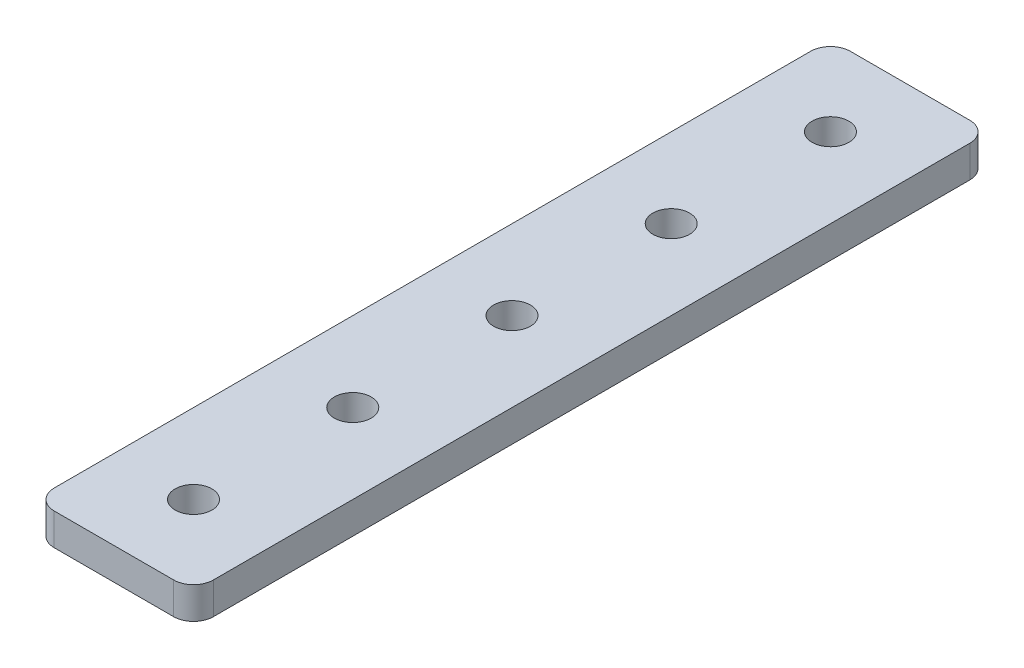
ISO-10303-21;
HEADER;
FILE_DESCRIPTION(('STEP AP214'),'2;1');
FILE_NAME('part.step','',(''),(''),'','','');
FILE_SCHEMA(('AUTOMOTIVE_DESIGN { 1 0 10303 214 1 1 1 1 }'));
ENDSEC;
DATA;
#1=APPLICATION_CONTEXT('core data for automotive mechanical design processes');
#2=APPLICATION_PROTOCOL_DEFINITION('international standard','automotive_design',2000,#1);
#3=PRODUCT_CONTEXT('',#1,'mechanical');
#4=PRODUCT('Part','Part','',(#3));
#5=PRODUCT_RELATED_PRODUCT_CATEGORY('part','',(#4));
#6=PRODUCT_DEFINITION_FORMATION('','',#4);
#7=PRODUCT_DEFINITION_CONTEXT('part definition',#1,'design');
#8=PRODUCT_DEFINITION('design','',#6,#7);
#9=PRODUCT_DEFINITION_SHAPE('','',#8);
#10=(LENGTH_UNIT() NAMED_UNIT(*) SI_UNIT(.MILLI.,.METRE.));
#11=(NAMED_UNIT(*) PLANE_ANGLE_UNIT() SI_UNIT($,.RADIAN.));
#12=(NAMED_UNIT(*) SI_UNIT($,.STERADIAN.) SOLID_ANGLE_UNIT());
#13=UNCERTAINTY_MEASURE_WITH_UNIT(LENGTH_MEASURE(1.E-05),#10,'distance_accuracy_value','');
#14=(GEOMETRIC_REPRESENTATION_CONTEXT(3) GLOBAL_UNCERTAINTY_ASSIGNED_CONTEXT((#13)) GLOBAL_UNIT_ASSIGNED_CONTEXT((#10,
#11,#12)) REPRESENTATION_CONTEXT('',''));
#15=CARTESIAN_POINT('',(0.,0.,0.));
#16=DIRECTION('',(0.,0.,1.));
#17=DIRECTION('',(1.,0.,0.));
#18=AXIS2_PLACEMENT_3D('',#15,#16,#17);
#19=CARTESIAN_POINT('',(-38.6467729963785,364.577314871582,-80.));
#20=DIRECTION('',(0.,0.,-1.));
#21=DIRECTION('',(-1.,0.,0.));
#22=AXIS2_PLACEMENT_3D('',#19,#20,#21);
#23=PLANE('',#22);
#24=DIRECTION('',(-1.,0.,0.));
#25=VECTOR('',#24,1.);
#26=CARTESIAN_POINT('',(6.,3.2,-80.));
#27=LINE('',#26,#25);
#28=CARTESIAN_POINT('',(6.,3.2,-80.));
#29=VERTEX_POINT('',#28);
#30=CARTESIAN_POINT('',(-6.,3.2,-80.));
#31=VERTEX_POINT('',#30);
#32=EDGE_CURVE('E146',#29,#31,#27,.T.);
#33=ORIENTED_EDGE('',*,*,#32,.F.);
#34=DIRECTION('',(0.,1.,0.));
#35=VECTOR('',#34,1.);
#36=CARTESIAN_POINT('',(6.,364.577314871582,-80.));
#37=LINE('',#36,#35);
#38=CARTESIAN_POINT('',(6.,0.,-80.));
#39=VERTEX_POINT('',#38);
#40=EDGE_CURVE('E161',#29,#39,#37,.F.);
#41=ORIENTED_EDGE('',*,*,#40,.T.);
#42=DIRECTION('',(-1.,0.,0.));
#43=VECTOR('',#42,1.);
#44=CARTESIAN_POINT('',(6.,0.,-80.));
#45=LINE('',#44,#43);
#46=CARTESIAN_POINT('',(-6.,0.,-80.));
#47=VERTEX_POINT('',#46);
#48=EDGE_CURVE('E166',#39,#47,#45,.T.);
#49=ORIENTED_EDGE('',*,*,#48,.T.);
#50=DIRECTION('',(0.,-1.,0.));
#51=VECTOR('',#50,1.);
#52=CARTESIAN_POINT('',(-6.,364.577314871582,-80.));
#53=LINE('',#52,#51);
#54=EDGE_CURVE('E159',#47,#31,#53,.F.);
#55=ORIENTED_EDGE('',*,*,#54,.T.);
#56=EDGE_LOOP('',(#33,#41,#49,#55));
#57=FACE_BOUND('',#56,.T.);
#58=ADVANCED_FACE('F33',(#57),#23,.T.);
#59=CARTESIAN_POINT('',(-8.,0.,-286.));
#60=DIRECTION('',(-1.,0.,0.));
#61=DIRECTION('',(0.,0.,1.));
#62=AXIS2_PLACEMENT_3D('',#59,#60,#61);
#63=PLANE('',#62);
#64=DIRECTION('',(0.,0.,1.));
#65=VECTOR('',#64,1.);
#66=CARTESIAN_POINT('',(-8.,3.2,-286.));
#67=LINE('',#66,#65);
#68=CARTESIAN_POINT('',(-8.,3.2,-78.));
#69=VERTEX_POINT('',#68);
#70=CARTESIAN_POINT('',(-8.,3.2,-2.));
#71=VERTEX_POINT('',#70);
#72=EDGE_CURVE('E141',#69,#71,#67,.T.);
#73=ORIENTED_EDGE('',*,*,#72,.F.);
#74=DIRECTION('',(0.,-1.,0.));
#75=VECTOR('',#74,1.);
#76=CARTESIAN_POINT('',(-8.,0.,-78.));
#77=LINE('',#76,#75);
#78=CARTESIAN_POINT('',(-8.,0.,-78.));
#79=VERTEX_POINT('',#78);
#80=EDGE_CURVE('E11',#69,#79,#77,.T.);
#81=ORIENTED_EDGE('',*,*,#80,.T.);
#82=DIRECTION('',(0.,0.,1.));
#83=VECTOR('',#82,1.);
#84=CARTESIAN_POINT('',(-8.,0.,-286.));
#85=LINE('',#84,#83);
#86=CARTESIAN_POINT('',(-8.,0.,-2.));
#87=VERTEX_POINT('',#86);
#88=EDGE_CURVE('E119',#79,#87,#85,.T.);
#89=ORIENTED_EDGE('',*,*,#88,.T.);
#90=DIRECTION('',(0.,1.,0.));
#91=VECTOR('',#90,1.);
#92=CARTESIAN_POINT('',(-8.,0.,-2.));
#93=LINE('',#92,#91);
#94=EDGE_CURVE('E110',#87,#71,#93,.T.);
#95=ORIENTED_EDGE('',*,*,#94,.T.);
#96=EDGE_LOOP('',(#73,#81,#89,#95));
#97=FACE_BOUND('',#96,.T.);
#98=ADVANCED_FACE('F183',(#97),#63,.T.);
#99=CARTESIAN_POINT('',(8.,0.,-2.));
#100=DIRECTION('',(1.,0.,0.));
#101=DIRECTION('',(0.,0.,-1.));
#102=AXIS2_PLACEMENT_3D('',#99,#100,#101);
#103=PLANE('',#102);
#104=DIRECTION('',(0.,0.,-1.));
#105=VECTOR('',#104,1.);
#106=CARTESIAN_POINT('',(8.,0.,-2.));
#107=LINE('',#106,#105);
#108=CARTESIAN_POINT('',(8.,0.,-2.));
#109=VERTEX_POINT('',#108);
#110=CARTESIAN_POINT('',(8.,0.,-78.));
#111=VERTEX_POINT('',#110);
#112=EDGE_CURVE('E102',#109,#111,#107,.T.);
#113=ORIENTED_EDGE('',*,*,#112,.T.);
#114=DIRECTION('',(0.,1.,0.));
#115=VECTOR('',#114,1.);
#116=CARTESIAN_POINT('',(8.,0.,-78.));
#117=LINE('',#116,#115);
#118=CARTESIAN_POINT('',(8.,3.2,-78.));
#119=VERTEX_POINT('',#118);
#120=EDGE_CURVE('E153',#111,#119,#117,.T.);
#121=ORIENTED_EDGE('',*,*,#120,.T.);
#122=DIRECTION('',(0.,0.,-1.));
#123=VECTOR('',#122,1.);
#124=CARTESIAN_POINT('',(8.,3.2,-2.));
#125=LINE('',#124,#123);
#126=CARTESIAN_POINT('',(8.,3.2,-2.));
#127=VERTEX_POINT('',#126);
#128=EDGE_CURVE('E105',#127,#119,#125,.T.);
#129=ORIENTED_EDGE('',*,*,#128,.F.);
#130=DIRECTION('',(0.,1.,0.));
#131=VECTOR('',#130,1.);
#132=CARTESIAN_POINT('',(8.,0.,-2.));
#133=LINE('',#132,#131);
#134=EDGE_CURVE('E98',#109,#127,#133,.T.);
#135=ORIENTED_EDGE('',*,*,#134,.F.);
#136=EDGE_LOOP('',(#113,#121,#129,#135));
#137=FACE_BOUND('',#136,.T.);
#138=ADVANCED_FACE('F100',(#137),#103,.T.);
#139=CARTESIAN_POINT('',(6.,0.,-2.));
#140=DIRECTION('',(0.,1.,0.));
#141=DIRECTION('',(0.,0.,1.));
#142=AXIS2_PLACEMENT_3D('',#139,#140,#141);
#143=PLANE('',#142);
#144=CARTESIAN_POINT('',(0.,0.,-72.));
#145=DIRECTION('',(0.,1.,0.));
#146=DIRECTION('',(0.,0.,-1.));
#147=AXIS2_PLACEMENT_3D('',#144,#145,#146);
#148=CIRCLE('',#147,1.85);
#149=CARTESIAN_POINT('',(0.,0.,-73.85));
#150=VERTEX_POINT('',#149);
#151=EDGE_CURVE('E139',#150,#150,#148,.T.);
#152=ORIENTED_EDGE('',*,*,#151,.T.);
#153=EDGE_LOOP('',(#152));
#154=FACE_BOUND('',#153,.T.);
#155=CARTESIAN_POINT('',(0.,0.,-56.));
#156=DIRECTION('',(0.,1.,0.));
#157=DIRECTION('',(0.,0.,-1.));
#158=AXIS2_PLACEMENT_3D('',#155,#156,#157);
#159=CIRCLE('',#158,1.85);
#160=CARTESIAN_POINT('',(0.,0.,-57.85));
#161=VERTEX_POINT('',#160);
#162=EDGE_CURVE('E346',#161,#161,#159,.T.);
#163=ORIENTED_EDGE('',*,*,#162,.T.);
#164=EDGE_LOOP('',(#163));
#165=FACE_BOUND('',#164,.T.);
#166=CARTESIAN_POINT('',(0.,0.,-40.));
#167=DIRECTION('',(0.,1.,0.));
#168=DIRECTION('',(0.,0.,-1.));
#169=AXIS2_PLACEMENT_3D('',#166,#167,#168);
#170=CIRCLE('',#169,1.85);
#171=CARTESIAN_POINT('',(0.,0.,-41.85));
#172=VERTEX_POINT('',#171);
#173=EDGE_CURVE('E342',#172,#172,#170,.T.);
#174=ORIENTED_EDGE('',*,*,#173,.T.);
#175=EDGE_LOOP('',(#174));
#176=FACE_BOUND('',#175,.T.);
#177=CARTESIAN_POINT('',(0.,0.,-24.));
#178=DIRECTION('',(0.,1.,0.));
#179=DIRECTION('',(0.,0.,-1.));
#180=AXIS2_PLACEMENT_3D('',#177,#178,#179);
#181=CIRCLE('',#180,1.85);
#182=CARTESIAN_POINT('',(0.,0.,-25.85));
#183=VERTEX_POINT('',#182);
#184=EDGE_CURVE('E338',#183,#183,#181,.T.);
#185=ORIENTED_EDGE('',*,*,#184,.T.);
#186=EDGE_LOOP('',(#185));
#187=FACE_BOUND('',#186,.T.);
#188=CARTESIAN_POINT('',(0.,0.,-8.));
#189=DIRECTION('',(0.,1.,0.));
#190=DIRECTION('',(0.,0.,-1.));
#191=AXIS2_PLACEMENT_3D('',#188,#189,#190);
#192=CIRCLE('',#191,1.85);
#193=CARTESIAN_POINT('',(0.,0.,-9.85));
#194=VERTEX_POINT('',#193);
#195=EDGE_CURVE('E333',#194,#194,#192,.T.);
#196=ORIENTED_EDGE('',*,*,#195,.T.);
#197=EDGE_LOOP('',(#196));
#198=FACE_BOUND('',#197,.T.);
#199=ORIENTED_EDGE('',*,*,#48,.F.);
#200=CARTESIAN_POINT('',(6.,0.,-78.));
#201=DIRECTION('',(0.,1.,0.));
#202=DIRECTION('',(0.,0.,1.));
#203=AXIS2_PLACEMENT_3D('',#200,#201,#202);
#204=CIRCLE('',#203,2.);
#205=EDGE_CURVE('E41',#39,#111,#204,.F.);
#206=ORIENTED_EDGE('',*,*,#205,.T.);
#207=ORIENTED_EDGE('',*,*,#112,.F.);
#208=CARTESIAN_POINT('',(6.,0.,-2.));
#209=DIRECTION('',(0.,1.,0.));
#210=DIRECTION('',(0.,0.,1.));
#211=AXIS2_PLACEMENT_3D('',#208,#209,#210);
#212=CIRCLE('',#211,2.);
#213=CARTESIAN_POINT('',(6.,0.,0.));
#214=VERTEX_POINT('',#213);
#215=EDGE_CURVE('E116',#214,#109,#212,.T.);
#216=ORIENTED_EDGE('',*,*,#215,.F.);
#217=DIRECTION('',(1.,0.,0.));
#218=VECTOR('',#217,1.);
#219=CARTESIAN_POINT('',(-6.,0.,0.));
#220=LINE('',#219,#218);
#221=CARTESIAN_POINT('',(-6.,0.,0.));
#222=VERTEX_POINT('',#221);
#223=EDGE_CURVE('E111',#222,#214,#220,.T.);
#224=ORIENTED_EDGE('',*,*,#223,.F.);
#225=CARTESIAN_POINT('',(-6.,0.,-2.));
#226=DIRECTION('',(0.,1.,0.));
#227=DIRECTION('',(0.,0.,1.));
#228=AXIS2_PLACEMENT_3D('',#225,#226,#227);
#229=CIRCLE('',#228,2.);
#230=EDGE_CURVE('E133',#87,#222,#229,.T.);
#231=ORIENTED_EDGE('',*,*,#230,.F.);
#232=ORIENTED_EDGE('',*,*,#88,.F.);
#233=CARTESIAN_POINT('',(-6.,0.,-78.));
#234=DIRECTION('',(0.,1.,0.));
#235=DIRECTION('',(0.,0.,1.));
#236=AXIS2_PLACEMENT_3D('',#233,#234,#235);
#237=CIRCLE('',#236,2.);
#238=EDGE_CURVE('E48',#79,#47,#237,.F.);
#239=ORIENTED_EDGE('',*,*,#238,.T.);
#240=EDGE_LOOP('',(#199,#206,#207,#216,#224,#231,#232,#239));
#241=FACE_BOUND('',#240,.T.);
#242=ADVANCED_FACE('F114',(#154,#165,#176,#187,#198,#241),#143,.F.);
#243=CARTESIAN_POINT('',(6.,3.2,-2.));
#244=DIRECTION('',(0.,1.,0.));
#245=DIRECTION('',(0.,0.,1.));
#246=AXIS2_PLACEMENT_3D('',#243,#244,#245);
#247=PLANE('',#246);
#248=CARTESIAN_POINT('',(0.,3.2,-72.));
#249=DIRECTION('',(0.,1.,0.));
#250=DIRECTION('',(0.,0.,-1.));
#251=AXIS2_PLACEMENT_3D('',#248,#249,#250);
#252=CIRCLE('',#251,1.85);
#253=CARTESIAN_POINT('',(0.,3.2,-73.85));
#254=VERTEX_POINT('',#253);
#255=EDGE_CURVE('E129',#254,#254,#252,.T.);
#256=ORIENTED_EDGE('',*,*,#255,.F.);
#257=EDGE_LOOP('',(#256));
#258=FACE_BOUND('',#257,.T.);
#259=CARTESIAN_POINT('',(0.,3.2,-56.));
#260=DIRECTION('',(0.,1.,0.));
#261=DIRECTION('',(0.,0.,-1.));
#262=AXIS2_PLACEMENT_3D('',#259,#260,#261);
#263=CIRCLE('',#262,1.85);
#264=CARTESIAN_POINT('',(0.,3.2,-57.85));
#265=VERTEX_POINT('',#264);
#266=EDGE_CURVE('E321',#265,#265,#263,.T.);
#267=ORIENTED_EDGE('',*,*,#266,.F.);
#268=EDGE_LOOP('',(#267));
#269=FACE_BOUND('',#268,.T.);
#270=CARTESIAN_POINT('',(0.,3.2,-40.));
#271=DIRECTION('',(0.,1.,0.));
#272=DIRECTION('',(0.,0.,-1.));
#273=AXIS2_PLACEMENT_3D('',#270,#271,#272);
#274=CIRCLE('',#273,1.85);
#275=CARTESIAN_POINT('',(0.,3.2,-41.85));
#276=VERTEX_POINT('',#275);
#277=EDGE_CURVE('E325',#276,#276,#274,.T.);
#278=ORIENTED_EDGE('',*,*,#277,.F.);
#279=EDGE_LOOP('',(#278));
#280=FACE_BOUND('',#279,.T.);
#281=CARTESIAN_POINT('',(0.,3.2,-24.));
#282=DIRECTION('',(0.,1.,0.));
#283=DIRECTION('',(0.,0.,-1.));
#284=AXIS2_PLACEMENT_3D('',#281,#282,#283);
#285=CIRCLE('',#284,1.85);
#286=CARTESIAN_POINT('',(0.,3.2,-25.85));
#287=VERTEX_POINT('',#286);
#288=EDGE_CURVE('E329',#287,#287,#285,.T.);
#289=ORIENTED_EDGE('',*,*,#288,.F.);
#290=EDGE_LOOP('',(#289));
#291=FACE_BOUND('',#290,.T.);
#292=CARTESIAN_POINT('',(0.,3.2,-8.));
#293=DIRECTION('',(0.,1.,0.));
#294=DIRECTION('',(0.,0.,-1.));
#295=AXIS2_PLACEMENT_3D('',#292,#293,#294);
#296=CIRCLE('',#295,1.85);
#297=CARTESIAN_POINT('',(0.,3.2,-9.85));
#298=VERTEX_POINT('',#297);
#299=EDGE_CURVE('E168',#298,#298,#296,.T.);
#300=ORIENTED_EDGE('',*,*,#299,.F.);
#301=EDGE_LOOP('',(#300));
#302=FACE_BOUND('',#301,.T.);
#303=ORIENTED_EDGE('',*,*,#128,.T.);
#304=CARTESIAN_POINT('',(6.,3.2,-78.));
#305=DIRECTION('',(0.,1.,0.));
#306=DIRECTION('',(0.,0.,1.));
#307=AXIS2_PLACEMENT_3D('',#304,#305,#306);
#308=CIRCLE('',#307,2.);
#309=EDGE_CURVE('E157',#119,#29,#308,.T.);
#310=ORIENTED_EDGE('',*,*,#309,.T.);
#311=ORIENTED_EDGE('',*,*,#32,.T.);
#312=CARTESIAN_POINT('',(-6.,3.2,-78.));
#313=DIRECTION('',(0.,1.,0.));
#314=DIRECTION('',(0.,0.,1.));
#315=AXIS2_PLACEMENT_3D('',#312,#313,#314);
#316=CIRCLE('',#315,2.);
#317=EDGE_CURVE('E155',#31,#69,#316,.T.);
#318=ORIENTED_EDGE('',*,*,#317,.T.);
#319=ORIENTED_EDGE('',*,*,#72,.T.);
#320=CARTESIAN_POINT('',(-6.,3.2,-2.));
#321=DIRECTION('',(0.,1.,0.));
#322=DIRECTION('',(0.,0.,1.));
#323=AXIS2_PLACEMENT_3D('',#320,#321,#322);
#324=CIRCLE('',#323,2.);
#325=CARTESIAN_POINT('',(-6.,3.2,0.));
#326=VERTEX_POINT('',#325);
#327=EDGE_CURVE('E126',#71,#326,#324,.T.);
#328=ORIENTED_EDGE('',*,*,#327,.T.);
#329=DIRECTION('',(1.,0.,0.));
#330=VECTOR('',#329,1.);
#331=CARTESIAN_POINT('',(-6.,3.2,0.));
#332=LINE('',#331,#330);
#333=CARTESIAN_POINT('',(6.,3.2,0.));
#334=VERTEX_POINT('',#333);
#335=EDGE_CURVE('E123',#326,#334,#332,.T.);
#336=ORIENTED_EDGE('',*,*,#335,.T.);
#337=CARTESIAN_POINT('',(6.,3.2,-2.));
#338=DIRECTION('',(0.,1.,0.));
#339=DIRECTION('',(0.,0.,1.));
#340=AXIS2_PLACEMENT_3D('',#337,#338,#339);
#341=CIRCLE('',#340,2.);
#342=EDGE_CURVE('E137',#334,#127,#341,.T.);
#343=ORIENTED_EDGE('',*,*,#342,.T.);
#344=EDGE_LOOP('',(#303,#310,#311,#318,#319,#328,#336,#343));
#345=FACE_BOUND('',#344,.T.);
#346=ADVANCED_FACE('F172',(#258,#269,#280,#291,#302,#345),#247,.T.);
#347=CARTESIAN_POINT('',(6.,0.,-2.));
#348=DIRECTION('',(0.,1.,0.));
#349=DIRECTION('',(0.,0.,1.));
#350=AXIS2_PLACEMENT_3D('',#347,#348,#349);
#351=CYLINDRICAL_SURFACE('',#350,2.);
#352=ORIENTED_EDGE('',*,*,#342,.F.);
#353=DIRECTION('',(0.,1.,0.));
#354=VECTOR('',#353,1.);
#355=CARTESIAN_POINT('',(6.,0.,0.));
#356=LINE('',#355,#354);
#357=EDGE_CURVE('E122',#214,#334,#356,.T.);
#358=ORIENTED_EDGE('',*,*,#357,.F.);
#359=ORIENTED_EDGE('',*,*,#215,.T.);
#360=ORIENTED_EDGE('',*,*,#134,.T.);
#361=EDGE_LOOP('',(#352,#358,#359,#360));
#362=FACE_BOUND('',#361,.T.);
#363=ADVANCED_FACE('F121',(#362),#351,.T.);
#364=CARTESIAN_POINT('',(-6.,0.,0.));
#365=DIRECTION('',(0.,0.,1.));
#366=DIRECTION('',(1.,0.,0.));
#367=AXIS2_PLACEMENT_3D('',#364,#365,#366);
#368=PLANE('',#367);
#369=ORIENTED_EDGE('',*,*,#335,.F.);
#370=DIRECTION('',(0.,1.,0.));
#371=VECTOR('',#370,1.);
#372=CARTESIAN_POINT('',(-6.,0.,0.));
#373=LINE('',#372,#371);
#374=EDGE_CURVE('E147',#222,#326,#373,.T.);
#375=ORIENTED_EDGE('',*,*,#374,.F.);
#376=ORIENTED_EDGE('',*,*,#223,.T.);
#377=ORIENTED_EDGE('',*,*,#357,.T.);
#378=EDGE_LOOP('',(#369,#375,#376,#377));
#379=FACE_BOUND('',#378,.T.);
#380=ADVANCED_FACE('F176',(#379),#368,.T.);
#381=CARTESIAN_POINT('',(-6.,0.,-2.));
#382=DIRECTION('',(0.,1.,0.));
#383=DIRECTION('',(0.,0.,1.));
#384=AXIS2_PLACEMENT_3D('',#381,#382,#383);
#385=CYLINDRICAL_SURFACE('',#384,2.);
#386=ORIENTED_EDGE('',*,*,#327,.F.);
#387=ORIENTED_EDGE('',*,*,#94,.F.);
#388=ORIENTED_EDGE('',*,*,#230,.T.);
#389=ORIENTED_EDGE('',*,*,#374,.T.);
#390=EDGE_LOOP('',(#386,#387,#388,#389));
#391=FACE_BOUND('',#390,.T.);
#392=ADVANCED_FACE('F180',(#391),#385,.T.);
#393=CARTESIAN_POINT('',(0.,0.,-72.));
#394=DIRECTION('',(0.,1.,0.));
#395=DIRECTION('',(0.,0.,1.));
#396=AXIS2_PLACEMENT_3D('',#393,#394,#395);
#397=CYLINDRICAL_SURFACE('',#396,1.85);
#398=ORIENTED_EDGE('',*,*,#151,.F.);
#399=EDGE_LOOP('',(#398));
#400=FACE_BOUND('',#399,.T.);
#401=ORIENTED_EDGE('',*,*,#255,.T.);
#402=EDGE_LOOP('',(#401));
#403=FACE_BOUND('',#402,.T.);
#404=ADVANCED_FACE('F212',(#400,#403),#397,.F.);
#405=CARTESIAN_POINT('',(0.,0.,-56.));
#406=DIRECTION('',(0.,1.,0.));
#407=DIRECTION('',(0.,0.,1.));
#408=AXIS2_PLACEMENT_3D('',#405,#406,#407);
#409=CYLINDRICAL_SURFACE('',#408,1.85);
#410=ORIENTED_EDGE('',*,*,#162,.F.);
#411=EDGE_LOOP('',(#410));
#412=FACE_BOUND('',#411,.T.);
#413=ORIENTED_EDGE('',*,*,#266,.T.);
#414=EDGE_LOOP('',(#413));
#415=FACE_BOUND('',#414,.T.);
#416=ADVANCED_FACE('F208',(#412,#415),#409,.F.);
#417=CARTESIAN_POINT('',(0.,0.,-40.));
#418=DIRECTION('',(0.,1.,0.));
#419=DIRECTION('',(0.,0.,1.));
#420=AXIS2_PLACEMENT_3D('',#417,#418,#419);
#421=CYLINDRICAL_SURFACE('',#420,1.85);
#422=ORIENTED_EDGE('',*,*,#173,.F.);
#423=EDGE_LOOP('',(#422));
#424=FACE_BOUND('',#423,.T.);
#425=ORIENTED_EDGE('',*,*,#277,.T.);
#426=EDGE_LOOP('',(#425));
#427=FACE_BOUND('',#426,.T.);
#428=ADVANCED_FACE('F204',(#424,#427),#421,.F.);
#429=CARTESIAN_POINT('',(0.,0.,-24.));
#430=DIRECTION('',(0.,1.,0.));
#431=DIRECTION('',(0.,0.,1.));
#432=AXIS2_PLACEMENT_3D('',#429,#430,#431);
#433=CYLINDRICAL_SURFACE('',#432,1.85);
#434=ORIENTED_EDGE('',*,*,#184,.F.);
#435=EDGE_LOOP('',(#434));
#436=FACE_BOUND('',#435,.T.);
#437=ORIENTED_EDGE('',*,*,#288,.T.);
#438=EDGE_LOOP('',(#437));
#439=FACE_BOUND('',#438,.T.);
#440=ADVANCED_FACE('F200',(#436,#439),#433,.F.);
#441=CARTESIAN_POINT('',(0.,0.,-8.));
#442=DIRECTION('',(0.,1.,0.));
#443=DIRECTION('',(0.,0.,1.));
#444=AXIS2_PLACEMENT_3D('',#441,#442,#443);
#445=CYLINDRICAL_SURFACE('',#444,1.85);
#446=ORIENTED_EDGE('',*,*,#195,.F.);
#447=EDGE_LOOP('',(#446));
#448=FACE_BOUND('',#447,.T.);
#449=ORIENTED_EDGE('',*,*,#299,.T.);
#450=EDGE_LOOP('',(#449));
#451=FACE_BOUND('',#450,.T.);
#452=ADVANCED_FACE('F189',(#448,#451),#445,.F.);
#453=CARTESIAN_POINT('',(6.,0.,-78.));
#454=DIRECTION('',(0.,1.,0.));
#455=DIRECTION('',(0.,0.,1.));
#456=AXIS2_PLACEMENT_3D('',#453,#454,#455);
#457=CYLINDRICAL_SURFACE('',#456,2.);
#458=ORIENTED_EDGE('',*,*,#205,.F.);
#459=ORIENTED_EDGE('',*,*,#40,.F.);
#460=ORIENTED_EDGE('',*,*,#309,.F.);
#461=ORIENTED_EDGE('',*,*,#120,.F.);
#462=EDGE_LOOP('',(#458,#459,#460,#461));
#463=FACE_BOUND('',#462,.T.);
#464=ADVANCED_FACE('F170',(#463),#457,.T.);
#465=CARTESIAN_POINT('',(-6.,0.,-78.));
#466=DIRECTION('',(0.,-1.,0.));
#467=DIRECTION('',(0.,0.,-1.));
#468=AXIS2_PLACEMENT_3D('',#465,#466,#467);
#469=CYLINDRICAL_SURFACE('',#468,2.);
#470=ORIENTED_EDGE('',*,*,#317,.F.);
#471=ORIENTED_EDGE('',*,*,#54,.F.);
#472=ORIENTED_EDGE('',*,*,#238,.F.);
#473=ORIENTED_EDGE('',*,*,#80,.F.);
#474=EDGE_LOOP('',(#470,#471,#472,#473));
#475=FACE_BOUND('',#474,.T.);
#476=ADVANCED_FACE('F35',(#475),#469,.T.);
#477=CLOSED_SHELL('',(#58,#98,#138,#242,#346,#363,#380,#392,#404,#416,#428,#440,#452,#464,#476));
#478=MANIFOLD_SOLID_BREP('B2',#477);
#479=ADVANCED_BREP_SHAPE_REPRESENTATION('',(#18,#478),#14);
#480=SHAPE_DEFINITION_REPRESENTATION(#9,#479);
ENDSEC;
END-ISO-10303-21;
